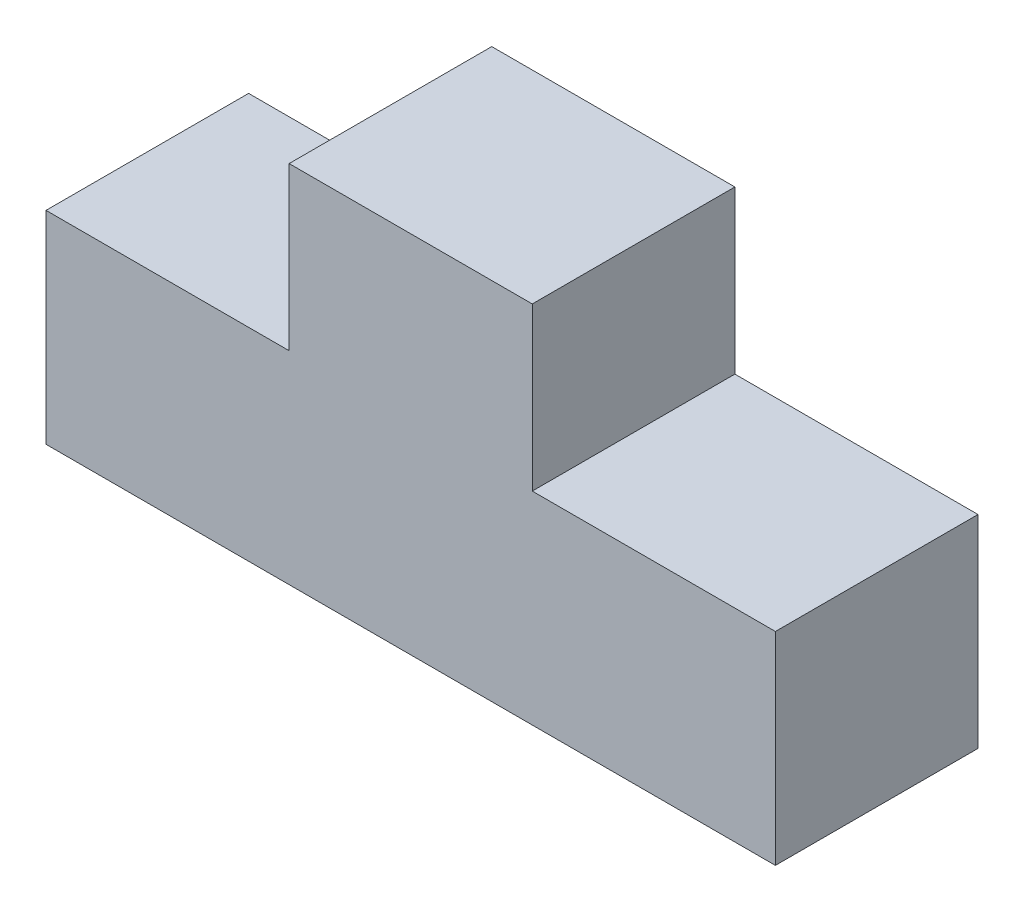
ISO-10303-21;
HEADER;
FILE_DESCRIPTION(('STEP AP214'),'2;1');
FILE_NAME('part.step','',(''),(''),'','','');
FILE_SCHEMA(('AUTOMOTIVE_DESIGN { 1 0 10303 214 1 1 1 1 }'));
ENDSEC;
DATA;
#1=APPLICATION_CONTEXT('core data for automotive mechanical design processes');
#2=APPLICATION_PROTOCOL_DEFINITION('international standard','automotive_design',2000,#1);
#3=PRODUCT_CONTEXT('',#1,'mechanical');
#4=PRODUCT('Part','Part','',(#3));
#5=PRODUCT_RELATED_PRODUCT_CATEGORY('part','',(#4));
#6=PRODUCT_DEFINITION_FORMATION('','',#4);
#7=PRODUCT_DEFINITION_CONTEXT('part definition',#1,'design');
#8=PRODUCT_DEFINITION('design','',#6,#7);
#9=PRODUCT_DEFINITION_SHAPE('','',#8);
#10=(LENGTH_UNIT() NAMED_UNIT(*) SI_UNIT(.MILLI.,.METRE.));
#11=(NAMED_UNIT(*) PLANE_ANGLE_UNIT() SI_UNIT($,.RADIAN.));
#12=(NAMED_UNIT(*) SI_UNIT($,.STERADIAN.) SOLID_ANGLE_UNIT());
#13=UNCERTAINTY_MEASURE_WITH_UNIT(LENGTH_MEASURE(1.E-05),#10,'distance_accuracy_value','');
#14=(GEOMETRIC_REPRESENTATION_CONTEXT(3) GLOBAL_UNCERTAINTY_ASSIGNED_CONTEXT((#13)) GLOBAL_UNIT_ASSIGNED_CONTEXT((#10,
#11,#12)) REPRESENTATION_CONTEXT('',''));
#15=CARTESIAN_POINT('',(0.,0.,0.));
#16=DIRECTION('',(0.,0.,1.));
#17=DIRECTION('',(1.,0.,0.));
#18=AXIS2_PLACEMENT_3D('',#15,#16,#17);
#19=CARTESIAN_POINT('',(0.,0.,-635.));
#20=DIRECTION('',(-1.,0.,0.));
#21=DIRECTION('',(0.,0.,1.));
#22=AXIS2_PLACEMENT_3D('',#19,#20,#21);
#23=PLANE('',#22);
#24=DIRECTION('',(0.,-1.,0.));
#25=VECTOR('',#24,1.);
#26=CARTESIAN_POINT('',(0.,0.,0.));
#27=LINE('',#26,#25);
#28=CARTESIAN_POINT('',(0.,635.,0.));
#29=VERTEX_POINT('',#28);
#30=CARTESIAN_POINT('',(0.,0.,0.));
#31=VERTEX_POINT('',#30);
#32=EDGE_CURVE('E130',#29,#31,#27,.T.);
#33=ORIENTED_EDGE('',*,*,#32,.F.);
#34=DIRECTION('',(0.,0.,1.));
#35=VECTOR('',#34,1.);
#36=CARTESIAN_POINT('',(0.,635.,-635.));
#37=LINE('',#36,#35);
#38=CARTESIAN_POINT('',(0.,635.,-635.));
#39=VERTEX_POINT('',#38);
#40=EDGE_CURVE('E11',#39,#29,#37,.T.);
#41=ORIENTED_EDGE('',*,*,#40,.F.);
#42=DIRECTION('',(0.,-1.,0.));
#43=VECTOR('',#42,1.);
#44=CARTESIAN_POINT('',(0.,0.,-635.));
#45=LINE('',#44,#43);
#46=CARTESIAN_POINT('',(0.,0.,-635.));
#47=VERTEX_POINT('',#46);
#48=EDGE_CURVE('E150',#39,#47,#45,.T.);
#49=ORIENTED_EDGE('',*,*,#48,.T.);
#50=DIRECTION('',(0.,0.,1.));
#51=VECTOR('',#50,1.);
#52=CARTESIAN_POINT('',(0.,0.,-635.));
#53=LINE('',#52,#51);
#54=EDGE_CURVE('E36',#47,#31,#53,.T.);
#55=ORIENTED_EDGE('',*,*,#54,.T.);
#56=EDGE_LOOP('',(#33,#41,#49,#55));
#57=FACE_BOUND('',#56,.T.);
#58=ADVANCED_FACE('F33',(#57),#23,.T.);
#59=CARTESIAN_POINT('',(0.,635.,-635.));
#60=DIRECTION('',(0.,1.,0.));
#61=DIRECTION('',(0.,0.,1.));
#62=AXIS2_PLACEMENT_3D('',#59,#60,#61);
#63=PLANE('',#62);
#64=DIRECTION('',(-1.,0.,0.));
#65=VECTOR('',#64,1.);
#66=CARTESIAN_POINT('',(0.,635.,0.));
#67=LINE('',#66,#65);
#68=CARTESIAN_POINT('',(762.,635.,0.));
#69=VERTEX_POINT('',#68);
#70=EDGE_CURVE('E148',#69,#29,#67,.T.);
#71=ORIENTED_EDGE('',*,*,#70,.F.);
#72=DIRECTION('',(0.,0.,1.));
#73=VECTOR('',#72,1.);
#74=CARTESIAN_POINT('',(762.,635.,-635.));
#75=LINE('',#74,#73);
#76=CARTESIAN_POINT('',(762.,635.,-635.));
#77=VERTEX_POINT('',#76);
#78=EDGE_CURVE('E42',#77,#69,#75,.T.);
#79=ORIENTED_EDGE('',*,*,#78,.F.);
#80=DIRECTION('',(-1.,0.,0.));
#81=VECTOR('',#80,1.);
#82=CARTESIAN_POINT('',(0.,635.,-635.));
#83=LINE('',#82,#81);
#84=EDGE_CURVE('E120',#77,#39,#83,.T.);
#85=ORIENTED_EDGE('',*,*,#84,.T.);
#86=ORIENTED_EDGE('',*,*,#40,.T.);
#87=EDGE_LOOP('',(#71,#79,#85,#86));
#88=FACE_BOUND('',#87,.T.);
#89=ADVANCED_FACE('F162',(#88),#63,.T.);
#90=CARTESIAN_POINT('',(762.,635.,-635.));
#91=DIRECTION('',(-1.,0.,0.));
#92=DIRECTION('',(0.,0.,1.));
#93=AXIS2_PLACEMENT_3D('',#90,#91,#92);
#94=PLANE('',#93);
#95=DIRECTION('',(0.,-1.,0.));
#96=VECTOR('',#95,1.);
#97=CARTESIAN_POINT('',(762.,635.,0.));
#98=LINE('',#97,#96);
#99=CARTESIAN_POINT('',(762.,1143.,0.));
#100=VERTEX_POINT('',#99);
#101=EDGE_CURVE('E107',#100,#69,#98,.T.);
#102=ORIENTED_EDGE('',*,*,#101,.F.);
#103=DIRECTION('',(0.,0.,1.));
#104=VECTOR('',#103,1.);
#105=CARTESIAN_POINT('',(762.,1143.,-635.));
#106=LINE('',#105,#104);
#107=CARTESIAN_POINT('',(762.,1143.,-635.));
#108=VERTEX_POINT('',#107);
#109=EDGE_CURVE('E102',#108,#100,#106,.T.);
#110=ORIENTED_EDGE('',*,*,#109,.F.);
#111=DIRECTION('',(0.,-1.,0.));
#112=VECTOR('',#111,1.);
#113=CARTESIAN_POINT('',(762.,635.,-635.));
#114=LINE('',#113,#112);
#115=EDGE_CURVE('E105',#108,#77,#114,.T.);
#116=ORIENTED_EDGE('',*,*,#115,.T.);
#117=ORIENTED_EDGE('',*,*,#78,.T.);
#118=EDGE_LOOP('',(#102,#110,#116,#117));
#119=FACE_BOUND('',#118,.T.);
#120=ADVANCED_FACE('F104',(#119),#94,.T.);
#121=CARTESIAN_POINT('',(762.,1143.,-635.));
#122=DIRECTION('',(0.,1.,0.));
#123=DIRECTION('',(0.,0.,1.));
#124=AXIS2_PLACEMENT_3D('',#121,#122,#123);
#125=PLANE('',#124);
#126=DIRECTION('',(-1.,0.,0.));
#127=VECTOR('',#126,1.);
#128=CARTESIAN_POINT('',(762.,1143.,0.));
#129=LINE('',#128,#127);
#130=CARTESIAN_POINT('',(1524.,1143.,0.));
#131=VERTEX_POINT('',#130);
#132=EDGE_CURVE('E145',#131,#100,#129,.T.);
#133=ORIENTED_EDGE('',*,*,#132,.F.);
#134=DIRECTION('',(0.,0.,1.));
#135=VECTOR('',#134,1.);
#136=CARTESIAN_POINT('',(1524.,1143.,-635.));
#137=LINE('',#136,#135);
#138=CARTESIAN_POINT('',(1524.,1143.,-635.));
#139=VERTEX_POINT('',#138);
#140=EDGE_CURVE('E112',#139,#131,#137,.T.);
#141=ORIENTED_EDGE('',*,*,#140,.F.);
#142=DIRECTION('',(-1.,0.,0.));
#143=VECTOR('',#142,1.);
#144=CARTESIAN_POINT('',(762.,1143.,-635.));
#145=LINE('',#144,#143);
#146=EDGE_CURVE('E118',#139,#108,#145,.T.);
#147=ORIENTED_EDGE('',*,*,#146,.T.);
#148=ORIENTED_EDGE('',*,*,#109,.T.);
#149=EDGE_LOOP('',(#133,#141,#147,#148));
#150=FACE_BOUND('',#149,.T.);
#151=ADVANCED_FACE('F122',(#150),#125,.T.);
#152=CARTESIAN_POINT('',(1524.,1143.,-635.));
#153=DIRECTION('',(1.,0.,0.));
#154=DIRECTION('',(0.,1.,0.));
#155=AXIS2_PLACEMENT_3D('',#152,#153,#154);
#156=PLANE('',#155);
#157=DIRECTION('',(0.,1.,0.));
#158=VECTOR('',#157,1.);
#159=CARTESIAN_POINT('',(1524.,1143.,0.));
#160=LINE('',#159,#158);
#161=CARTESIAN_POINT('',(1524.,635.,0.));
#162=VERTEX_POINT('',#161);
#163=EDGE_CURVE('E142',#162,#131,#160,.T.);
#164=ORIENTED_EDGE('',*,*,#163,.F.);
#165=DIRECTION('',(0.,0.,1.));
#166=VECTOR('',#165,1.);
#167=CARTESIAN_POINT('',(1524.,635.,-635.));
#168=LINE('',#167,#166);
#169=CARTESIAN_POINT('',(1524.,635.,-635.));
#170=VERTEX_POINT('',#169);
#171=EDGE_CURVE('E154',#170,#162,#168,.T.);
#172=ORIENTED_EDGE('',*,*,#171,.F.);
#173=DIRECTION('',(0.,1.,0.));
#174=VECTOR('',#173,1.);
#175=CARTESIAN_POINT('',(1524.,1143.,-635.));
#176=LINE('',#175,#174);
#177=EDGE_CURVE('E123',#170,#139,#176,.T.);
#178=ORIENTED_EDGE('',*,*,#177,.T.);
#179=ORIENTED_EDGE('',*,*,#140,.T.);
#180=EDGE_LOOP('',(#164,#172,#178,#179));
#181=FACE_BOUND('',#180,.T.);
#182=ADVANCED_FACE('F175',(#181),#156,.T.);
#183=CARTESIAN_POINT('',(1524.,635.,-635.));
#184=DIRECTION('',(0.,1.,0.));
#185=DIRECTION('',(0.,0.,1.));
#186=AXIS2_PLACEMENT_3D('',#183,#184,#185);
#187=PLANE('',#186);
#188=DIRECTION('',(-1.,0.,0.));
#189=VECTOR('',#188,1.);
#190=CARTESIAN_POINT('',(1524.,635.,0.));
#191=LINE('',#190,#189);
#192=CARTESIAN_POINT('',(2286.,635.,0.));
#193=VERTEX_POINT('',#192);
#194=EDGE_CURVE('E139',#193,#162,#191,.T.);
#195=ORIENTED_EDGE('',*,*,#194,.F.);
#196=DIRECTION('',(0.,0.,1.));
#197=VECTOR('',#196,1.);
#198=CARTESIAN_POINT('',(2286.,635.,-635.));
#199=LINE('',#198,#197);
#200=CARTESIAN_POINT('',(2286.,635.,-635.));
#201=VERTEX_POINT('',#200);
#202=EDGE_CURVE('E156',#201,#193,#199,.T.);
#203=ORIENTED_EDGE('',*,*,#202,.F.);
#204=DIRECTION('',(-1.,0.,0.));
#205=VECTOR('',#204,1.);
#206=CARTESIAN_POINT('',(1524.,635.,-635.));
#207=LINE('',#206,#205);
#208=EDGE_CURVE('E125',#201,#170,#207,.T.);
#209=ORIENTED_EDGE('',*,*,#208,.T.);
#210=ORIENTED_EDGE('',*,*,#171,.T.);
#211=EDGE_LOOP('',(#195,#203,#209,#210));
#212=FACE_BOUND('',#211,.T.);
#213=ADVANCED_FACE('F178',(#212),#187,.T.);
#214=CARTESIAN_POINT('',(2286.,0.,-635.));
#215=DIRECTION('',(1.,0.,0.));
#216=DIRECTION('',(0.,0.,-1.));
#217=AXIS2_PLACEMENT_3D('',#214,#215,#216);
#218=PLANE('',#217);
#219=DIRECTION('',(0.,1.,0.));
#220=VECTOR('',#219,1.);
#221=CARTESIAN_POINT('',(2286.,0.,0.));
#222=LINE('',#221,#220);
#223=CARTESIAN_POINT('',(2286.,0.,0.));
#224=VERTEX_POINT('',#223);
#225=EDGE_CURVE('E136',#224,#193,#222,.T.);
#226=ORIENTED_EDGE('',*,*,#225,.F.);
#227=DIRECTION('',(0.,0.,1.));
#228=VECTOR('',#227,1.);
#229=CARTESIAN_POINT('',(2286.,0.,-635.));
#230=LINE('',#229,#228);
#231=CARTESIAN_POINT('',(2286.,0.,-635.));
#232=VERTEX_POINT('',#231);
#233=EDGE_CURVE('E157',#232,#224,#230,.T.);
#234=ORIENTED_EDGE('',*,*,#233,.F.);
#235=DIRECTION('',(0.,1.,0.));
#236=VECTOR('',#235,1.);
#237=CARTESIAN_POINT('',(2286.,0.,-635.));
#238=LINE('',#237,#236);
#239=EDGE_CURVE('E253',#232,#201,#238,.T.);
#240=ORIENTED_EDGE('',*,*,#239,.T.);
#241=ORIENTED_EDGE('',*,*,#202,.T.);
#242=EDGE_LOOP('',(#226,#234,#240,#241));
#243=FACE_BOUND('',#242,.T.);
#244=ADVANCED_FACE('F182',(#243),#218,.T.);
#245=CARTESIAN_POINT('',(0.,0.,-635.));
#246=DIRECTION('',(0.,-1.,0.));
#247=DIRECTION('',(0.,0.,-1.));
#248=AXIS2_PLACEMENT_3D('',#245,#246,#247);
#249=PLANE('',#248);
#250=DIRECTION('',(1.,0.,0.));
#251=VECTOR('',#250,1.);
#252=CARTESIAN_POINT('',(0.,0.,0.));
#253=LINE('',#252,#251);
#254=EDGE_CURVE('E133',#31,#224,#253,.T.);
#255=ORIENTED_EDGE('',*,*,#254,.F.);
#256=ORIENTED_EDGE('',*,*,#54,.F.);
#257=DIRECTION('',(1.,0.,0.));
#258=VECTOR('',#257,1.);
#259=CARTESIAN_POINT('',(0.,0.,-635.));
#260=LINE('',#259,#258);
#261=EDGE_CURVE('E254',#47,#232,#260,.T.);
#262=ORIENTED_EDGE('',*,*,#261,.T.);
#263=ORIENTED_EDGE('',*,*,#233,.T.);
#264=EDGE_LOOP('',(#255,#256,#262,#263));
#265=FACE_BOUND('',#264,.T.);
#266=ADVANCED_FACE('F159',(#265),#249,.T.);
#267=CARTESIAN_POINT('',(0.,0.,-635.));
#268=DIRECTION('',(0.,0.,-1.));
#269=DIRECTION('',(-1.,0.,0.));
#270=AXIS2_PLACEMENT_3D('',#267,#268,#269);
#271=PLANE('',#270);
#272=ORIENTED_EDGE('',*,*,#48,.F.);
#273=ORIENTED_EDGE('',*,*,#84,.F.);
#274=ORIENTED_EDGE('',*,*,#115,.F.);
#275=ORIENTED_EDGE('',*,*,#146,.F.);
#276=ORIENTED_EDGE('',*,*,#177,.F.);
#277=ORIENTED_EDGE('',*,*,#208,.F.);
#278=ORIENTED_EDGE('',*,*,#239,.F.);
#279=ORIENTED_EDGE('',*,*,#261,.F.);
#280=EDGE_LOOP('',(#272,#273,#274,#275,#276,#277,#278,#279));
#281=FACE_BOUND('',#280,.T.);
#282=ADVANCED_FACE('F116',(#281),#271,.T.);
#283=CARTESIAN_POINT('',(0.,0.,0.));
#284=DIRECTION('',(0.,0.,-1.));
#285=DIRECTION('',(-1.,0.,0.));
#286=AXIS2_PLACEMENT_3D('',#283,#284,#285);
#287=PLANE('',#286);
#288=ORIENTED_EDGE('',*,*,#32,.T.);
#289=ORIENTED_EDGE('',*,*,#254,.T.);
#290=ORIENTED_EDGE('',*,*,#225,.T.);
#291=ORIENTED_EDGE('',*,*,#194,.T.);
#292=ORIENTED_EDGE('',*,*,#163,.T.);
#293=ORIENTED_EDGE('',*,*,#132,.T.);
#294=ORIENTED_EDGE('',*,*,#101,.T.);
#295=ORIENTED_EDGE('',*,*,#70,.T.);
#296=EDGE_LOOP('',(#288,#289,#290,#291,#292,#293,#294,#295));
#297=FACE_BOUND('',#296,.T.);
#298=ADVANCED_FACE('F161',(#297),#287,.F.);
#299=CLOSED_SHELL('',(#58,#89,#120,#151,#182,#213,#244,#266,#282,#298));
#300=MANIFOLD_SOLID_BREP('B2',#299);
#301=ADVANCED_BREP_SHAPE_REPRESENTATION('',(#18,#300),#14);
#302=SHAPE_DEFINITION_REPRESENTATION(#9,#301);
ENDSEC;
END-ISO-10303-21;
